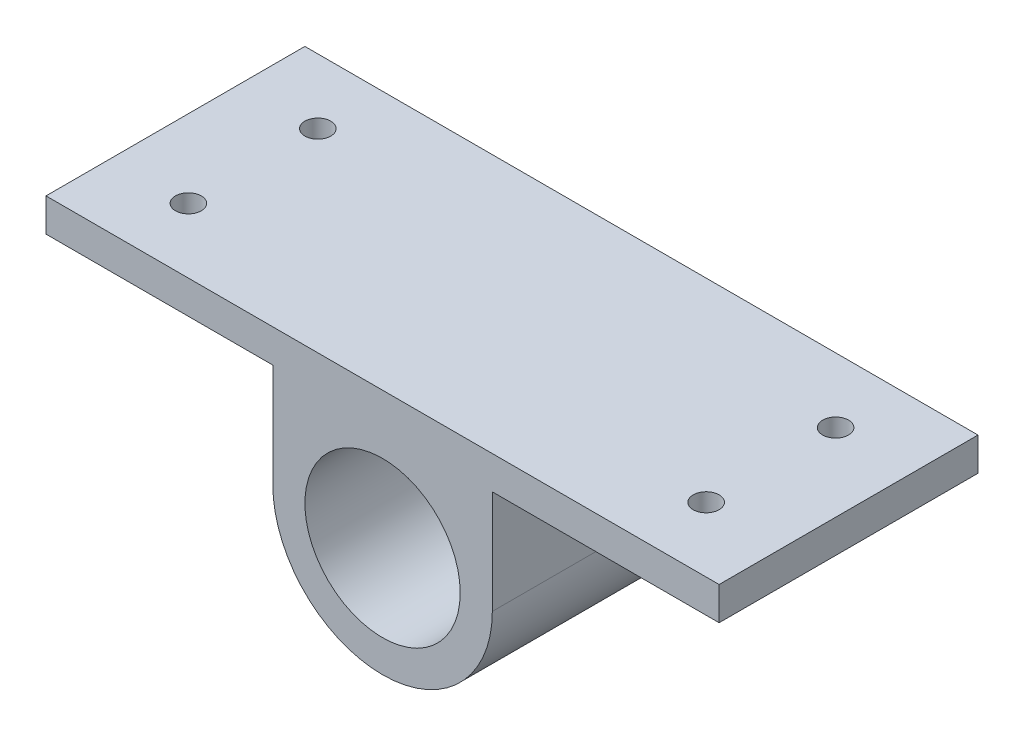
ISO-10303-21;
HEADER;
FILE_DESCRIPTION(('STEP AP214'),'2;1');
FILE_NAME('part.step','',(''),(''),'','','');
FILE_SCHEMA(('AUTOMOTIVE_DESIGN { 1 0 10303 214 1 1 1 1 }'));
ENDSEC;
DATA;
#1=APPLICATION_CONTEXT('core data for automotive mechanical design processes');
#2=APPLICATION_PROTOCOL_DEFINITION('international standard','automotive_design',2000,#1);
#3=PRODUCT_CONTEXT('',#1,'mechanical');
#4=PRODUCT('Part','Part','',(#3));
#5=PRODUCT_RELATED_PRODUCT_CATEGORY('part','',(#4));
#6=PRODUCT_DEFINITION_FORMATION('','',#4);
#7=PRODUCT_DEFINITION_CONTEXT('part definition',#1,'design');
#8=PRODUCT_DEFINITION('design','',#6,#7);
#9=PRODUCT_DEFINITION_SHAPE('','',#8);
#10=(LENGTH_UNIT() NAMED_UNIT(*) SI_UNIT(.MILLI.,.METRE.));
#11=(NAMED_UNIT(*) PLANE_ANGLE_UNIT() SI_UNIT($,.RADIAN.));
#12=(NAMED_UNIT(*) SI_UNIT($,.STERADIAN.) SOLID_ANGLE_UNIT());
#13=UNCERTAINTY_MEASURE_WITH_UNIT(LENGTH_MEASURE(1.E-05),#10,'distance_accuracy_value','');
#14=(GEOMETRIC_REPRESENTATION_CONTEXT(3) GLOBAL_UNCERTAINTY_ASSIGNED_CONTEXT((#13)) GLOBAL_UNIT_ASSIGNED_CONTEXT((#10,
#11,#12)) REPRESENTATION_CONTEXT('',''));
#15=CARTESIAN_POINT('',(0.,0.,0.));
#16=DIRECTION('',(0.,0.,1.));
#17=DIRECTION('',(1.,0.,0.));
#18=AXIS2_PLACEMENT_3D('',#15,#16,#17);
#19=CARTESIAN_POINT('',(-106.,0.,250.));
#20=DIRECTION('',(-1.,0.,0.));
#21=DIRECTION('',(0.,-1.,0.));
#22=AXIS2_PLACEMENT_3D('',#19,#20,#21);
#23=PLANE('',#22);
#24=DIRECTION('',(0.,1.,0.));
#25=VECTOR('',#24,1.);
#26=CARTESIAN_POINT('',(-106.,0.,0.));
#27=LINE('',#26,#25);
#28=CARTESIAN_POINT('',(-106.,-132.,0.));
#29=VERTEX_POINT('',#28);
#30=CARTESIAN_POINT('',(-106.,-32.,0.));
#31=VERTEX_POINT('',#30);
#32=EDGE_CURVE('E147',#29,#31,#27,.T.);
#33=ORIENTED_EDGE('',*,*,#32,.F.);
#34=DIRECTION('',(0.,0.,-1.));
#35=VECTOR('',#34,1.);
#36=CARTESIAN_POINT('',(-106.,-132.,250.));
#37=LINE('',#36,#35);
#38=CARTESIAN_POINT('',(-106.,-132.,250.));
#39=VERTEX_POINT('',#38);
#40=EDGE_CURVE('E11',#39,#29,#37,.T.);
#41=ORIENTED_EDGE('',*,*,#40,.F.);
#42=DIRECTION('',(0.,1.,0.));
#43=VECTOR('',#42,1.);
#44=CARTESIAN_POINT('',(-106.,0.,250.));
#45=LINE('',#44,#43);
#46=CARTESIAN_POINT('',(-106.,-32.,250.));
#47=VERTEX_POINT('',#46);
#48=EDGE_CURVE('E162',#39,#47,#45,.T.);
#49=ORIENTED_EDGE('',*,*,#48,.T.);
#50=DIRECTION('',(0.,0.,-1.));
#51=VECTOR('',#50,1.);
#52=CARTESIAN_POINT('',(-106.,-32.,250.));
#53=LINE('',#52,#51);
#54=EDGE_CURVE('E88',#47,#31,#53,.T.);
#55=ORIENTED_EDGE('',*,*,#54,.T.);
#56=EDGE_LOOP('',(#33,#41,#49,#55));
#57=FACE_BOUND('',#56,.T.);
#58=ADVANCED_FACE('F35',(#57),#23,.T.);
#59=CARTESIAN_POINT('',(0.,-132.,250.));
#60=DIRECTION('',(0.,0.,-1.));
#61=DIRECTION('',(-1.,0.,0.));
#62=AXIS2_PLACEMENT_3D('',#59,#60,#61);
#63=CYLINDRICAL_SURFACE('',#62,106.);
#64=CARTESIAN_POINT('',(0.,-132.,0.));
#65=DIRECTION('',(0.,0.,1.));
#66=DIRECTION('',(1.,0.,0.));
#67=AXIS2_PLACEMENT_3D('',#64,#65,#66);
#68=CIRCLE('',#67,106.);
#69=CARTESIAN_POINT('',(106.,-132.,0.));
#70=VERTEX_POINT('',#69);
#71=EDGE_CURVE('E175',#29,#70,#68,.T.);
#72=ORIENTED_EDGE('',*,*,#71,.T.);
#73=DIRECTION('',(0.,0.,-1.));
#74=VECTOR('',#73,1.);
#75=CARTESIAN_POINT('',(106.,-132.,250.));
#76=LINE('',#75,#74);
#77=CARTESIAN_POINT('',(106.,-132.,250.));
#78=VERTEX_POINT('',#77);
#79=EDGE_CURVE('E45',#78,#70,#76,.T.);
#80=ORIENTED_EDGE('',*,*,#79,.F.);
#81=CARTESIAN_POINT('',(0.,-132.,250.));
#82=DIRECTION('',(0.,0.,1.));
#83=DIRECTION('',(1.,0.,0.));
#84=AXIS2_PLACEMENT_3D('',#81,#82,#83);
#85=CIRCLE('',#84,106.);
#86=EDGE_CURVE('E164',#39,#78,#85,.T.);
#87=ORIENTED_EDGE('',*,*,#86,.F.);
#88=ORIENTED_EDGE('',*,*,#40,.T.);
#89=EDGE_LOOP('',(#72,#80,#87,#88));
#90=FACE_BOUND('',#89,.T.);
#91=ADVANCED_FACE('F195',(#90),#63,.T.);
#92=CARTESIAN_POINT('',(106.,0.,250.));
#93=DIRECTION('',(-1.,0.,0.));
#94=DIRECTION('',(0.,-1.,0.));
#95=AXIS2_PLACEMENT_3D('',#92,#93,#94);
#96=PLANE('',#95);
#97=DIRECTION('',(0.,1.,0.));
#98=VECTOR('',#97,1.);
#99=CARTESIAN_POINT('',(106.,0.,0.));
#100=LINE('',#99,#98);
#101=CARTESIAN_POINT('',(106.,-32.0000000000001,0.));
#102=VERTEX_POINT('',#101);
#103=EDGE_CURVE('E178',#70,#102,#100,.T.);
#104=ORIENTED_EDGE('',*,*,#103,.T.);
#105=DIRECTION('',(0.,0.,-1.));
#106=VECTOR('',#105,1.);
#107=CARTESIAN_POINT('',(106.,-32.0000000000001,250.));
#108=LINE('',#107,#106);
#109=CARTESIAN_POINT('',(106.,-32.0000000000001,250.));
#110=VERTEX_POINT('',#109);
#111=EDGE_CURVE('E137',#110,#102,#108,.T.);
#112=ORIENTED_EDGE('',*,*,#111,.F.);
#113=DIRECTION('',(0.,1.,0.));
#114=VECTOR('',#113,1.);
#115=CARTESIAN_POINT('',(106.,0.,250.));
#116=LINE('',#115,#114);
#117=EDGE_CURVE('E167',#78,#110,#116,.T.);
#118=ORIENTED_EDGE('',*,*,#117,.F.);
#119=ORIENTED_EDGE('',*,*,#79,.T.);
#120=EDGE_LOOP('',(#104,#112,#118,#119));
#121=FACE_BOUND('',#120,.T.);
#122=ADVANCED_FACE('F199',(#121),#96,.F.);
#123=CARTESIAN_POINT('',(0.,-32.0000000000001,250.));
#124=DIRECTION('',(0.,-1.,0.));
#125=DIRECTION('',(0.,0.,-1.));
#126=AXIS2_PLACEMENT_3D('',#123,#124,#125);
#127=PLANE('',#126);
#128=CARTESIAN_POINT('',(250.,-32.0000000000001,187.5));
#129=DIRECTION('',(0.,-1.,0.));
#130=DIRECTION('',(0.,0.,-1.));
#131=AXIS2_PLACEMENT_3D('',#128,#129,#130);
#132=CIRCLE('',#131,12.5);
#133=CARTESIAN_POINT('',(250.,-32.0000000000001,175.));
#134=VERTEX_POINT('',#133);
#135=EDGE_CURVE('E150',#134,#134,#132,.T.);
#136=ORIENTED_EDGE('',*,*,#135,.F.);
#137=EDGE_LOOP('',(#136));
#138=FACE_BOUND('',#137,.T.);
#139=CARTESIAN_POINT('',(250.,-32.0000000000001,62.5));
#140=DIRECTION('',(0.,-1.,0.));
#141=DIRECTION('',(0.,0.,-1.));
#142=AXIS2_PLACEMENT_3D('',#139,#140,#141);
#143=CIRCLE('',#142,12.5);
#144=CARTESIAN_POINT('',(250.,-32.0000000000001,50.));
#145=VERTEX_POINT('',#144);
#146=EDGE_CURVE('E155',#145,#145,#143,.T.);
#147=ORIENTED_EDGE('',*,*,#146,.F.);
#148=EDGE_LOOP('',(#147));
#149=FACE_BOUND('',#148,.T.);
#150=DIRECTION('',(-1.,0.,0.));
#151=VECTOR('',#150,1.);
#152=CARTESIAN_POINT('',(0.,-32.0000000000001,0.));
#153=LINE('',#152,#151);
#154=CARTESIAN_POINT('',(325.,-32.0000000000001,0.));
#155=VERTEX_POINT('',#154);
#156=EDGE_CURVE('E181',#155,#102,#153,.T.);
#157=ORIENTED_EDGE('',*,*,#156,.F.);
#158=DIRECTION('',(0.,0.,-1.));
#159=VECTOR('',#158,1.);
#160=CARTESIAN_POINT('',(325.,-32.0000000000001,250.));
#161=LINE('',#160,#159);
#162=CARTESIAN_POINT('',(325.,-32.0000000000001,250.));
#163=VERTEX_POINT('',#162);
#164=EDGE_CURVE('E131',#163,#155,#161,.T.);
#165=ORIENTED_EDGE('',*,*,#164,.F.);
#166=DIRECTION('',(-1.,0.,0.));
#167=VECTOR('',#166,1.);
#168=CARTESIAN_POINT('',(0.,-32.0000000000001,250.));
#169=LINE('',#168,#167);
#170=EDGE_CURVE('E169',#163,#110,#169,.T.);
#171=ORIENTED_EDGE('',*,*,#170,.T.);
#172=ORIENTED_EDGE('',*,*,#111,.T.);
#173=EDGE_LOOP('',(#157,#165,#171,#172));
#174=FACE_BOUND('',#173,.T.);
#175=ADVANCED_FACE('F205',(#138,#149,#174),#127,.T.);
#176=CARTESIAN_POINT('',(325.,0.,250.));
#177=DIRECTION('',(1.,0.,0.));
#178=DIRECTION('',(0.,0.,-1.));
#179=AXIS2_PLACEMENT_3D('',#176,#177,#178);
#180=PLANE('',#179);
#181=DIRECTION('',(0.,-1.,0.));
#182=VECTOR('',#181,1.);
#183=CARTESIAN_POINT('',(325.,0.,0.));
#184=LINE('',#183,#182);
#185=CARTESIAN_POINT('',(325.,0.,0.));
#186=VERTEX_POINT('',#185);
#187=EDGE_CURVE('E184',#186,#155,#184,.T.);
#188=ORIENTED_EDGE('',*,*,#187,.F.);
#189=DIRECTION('',(0.,0.,-1.));
#190=VECTOR('',#189,1.);
#191=CARTESIAN_POINT('',(325.,0.,250.));
#192=LINE('',#191,#190);
#193=CARTESIAN_POINT('',(325.,0.,250.));
#194=VERTEX_POINT('',#193);
#195=EDGE_CURVE('E129',#194,#186,#192,.T.);
#196=ORIENTED_EDGE('',*,*,#195,.F.);
#197=DIRECTION('',(0.,-1.,0.));
#198=VECTOR('',#197,1.);
#199=CARTESIAN_POINT('',(325.,0.,250.));
#200=LINE('',#199,#198);
#201=EDGE_CURVE('E123',#194,#163,#200,.T.);
#202=ORIENTED_EDGE('',*,*,#201,.T.);
#203=ORIENTED_EDGE('',*,*,#164,.T.);
#204=EDGE_LOOP('',(#188,#196,#202,#203));
#205=FACE_BOUND('',#204,.T.);
#206=ADVANCED_FACE('F209',(#205),#180,.T.);
#207=CARTESIAN_POINT('',(0.,0.,250.));
#208=DIRECTION('',(0.,-1.,0.));
#209=DIRECTION('',(1.,0.,0.));
#210=AXIS2_PLACEMENT_3D('',#207,#208,#209);
#211=PLANE('',#210);
#212=CARTESIAN_POINT('',(-250.,0.,62.5));
#213=DIRECTION('',(0.,1.,0.));
#214=DIRECTION('',(-1.,0.,0.));
#215=AXIS2_PLACEMENT_3D('',#212,#213,#214);
#216=CIRCLE('',#215,12.5);
#217=CARTESIAN_POINT('',(-262.5,0.,62.5));
#218=VERTEX_POINT('',#217);
#219=EDGE_CURVE('E247',#218,#218,#216,.T.);
#220=ORIENTED_EDGE('',*,*,#219,.F.);
#221=EDGE_LOOP('',(#220));
#222=FACE_BOUND('',#221,.T.);
#223=CARTESIAN_POINT('',(250.,0.,187.5));
#224=DIRECTION('',(0.,1.,0.));
#225=DIRECTION('',(1.,0.,0.));
#226=AXIS2_PLACEMENT_3D('',#223,#224,#225);
#227=CIRCLE('',#226,12.5);
#228=CARTESIAN_POINT('',(262.5,0.,187.5));
#229=VERTEX_POINT('',#228);
#230=EDGE_CURVE('E251',#229,#229,#227,.T.);
#231=ORIENTED_EDGE('',*,*,#230,.F.);
#232=EDGE_LOOP('',(#231));
#233=FACE_BOUND('',#232,.T.);
#234=CARTESIAN_POINT('',(250.,0.,62.5));
#235=DIRECTION('',(0.,1.,0.));
#236=DIRECTION('',(1.,0.,0.));
#237=AXIS2_PLACEMENT_3D('',#234,#235,#236);
#238=CIRCLE('',#237,12.5);
#239=CARTESIAN_POINT('',(262.5,0.,62.5));
#240=VERTEX_POINT('',#239);
#241=EDGE_CURVE('E254',#240,#240,#238,.T.);
#242=ORIENTED_EDGE('',*,*,#241,.F.);
#243=EDGE_LOOP('',(#242));
#244=FACE_BOUND('',#243,.T.);
#245=CARTESIAN_POINT('',(-250.,0.,187.5));
#246=DIRECTION('',(0.,1.,0.));
#247=DIRECTION('',(-1.,0.,0.));
#248=AXIS2_PLACEMENT_3D('',#245,#246,#247);
#249=CIRCLE('',#248,12.5);
#250=CARTESIAN_POINT('',(-262.5,0.,187.5));
#251=VERTEX_POINT('',#250);
#252=EDGE_CURVE('E143',#251,#251,#249,.T.);
#253=ORIENTED_EDGE('',*,*,#252,.F.);
#254=EDGE_LOOP('',(#253));
#255=FACE_BOUND('',#254,.T.);
#256=DIRECTION('',(-1.,0.,0.));
#257=VECTOR('',#256,1.);
#258=CARTESIAN_POINT('',(0.,0.,0.));
#259=LINE('',#258,#257);
#260=CARTESIAN_POINT('',(-325.,0.,0.));
#261=VERTEX_POINT('',#260);
#262=EDGE_CURVE('E128',#186,#261,#259,.T.);
#263=ORIENTED_EDGE('',*,*,#262,.T.);
#264=DIRECTION('',(0.,0.,-1.));
#265=VECTOR('',#264,1.);
#266=CARTESIAN_POINT('',(-325.,0.,250.));
#267=LINE('',#266,#265);
#268=CARTESIAN_POINT('',(-325.,0.,250.));
#269=VERTEX_POINT('',#268);
#270=EDGE_CURVE('E113',#269,#261,#267,.T.);
#271=ORIENTED_EDGE('',*,*,#270,.F.);
#272=DIRECTION('',(-1.,0.,0.));
#273=VECTOR('',#272,1.);
#274=CARTESIAN_POINT('',(0.,0.,250.));
#275=LINE('',#274,#273);
#276=EDGE_CURVE('E116',#194,#269,#275,.T.);
#277=ORIENTED_EDGE('',*,*,#276,.F.);
#278=ORIENTED_EDGE('',*,*,#195,.T.);
#279=EDGE_LOOP('',(#263,#271,#277,#278));
#280=FACE_BOUND('',#279,.T.);
#281=ADVANCED_FACE('F126',(#222,#233,#244,#255,#280),#211,.F.);
#282=CARTESIAN_POINT('',(-325.,0.,250.));
#283=DIRECTION('',(1.,0.,0.));
#284=DIRECTION('',(0.,0.,-1.));
#285=AXIS2_PLACEMENT_3D('',#282,#283,#284);
#286=PLANE('',#285);
#287=DIRECTION('',(0.,-1.,0.));
#288=VECTOR('',#287,1.);
#289=CARTESIAN_POINT('',(-325.,0.,0.));
#290=LINE('',#289,#288);
#291=CARTESIAN_POINT('',(-325.,-32.,0.));
#292=VERTEX_POINT('',#291);
#293=EDGE_CURVE('E188',#261,#292,#290,.T.);
#294=ORIENTED_EDGE('',*,*,#293,.T.);
#295=DIRECTION('',(0.,0.,-1.));
#296=VECTOR('',#295,1.);
#297=CARTESIAN_POINT('',(-325.,-32.,250.));
#298=LINE('',#297,#296);
#299=CARTESIAN_POINT('',(-325.,-32.,250.));
#300=VERTEX_POINT('',#299);
#301=EDGE_CURVE('E115',#300,#292,#298,.T.);
#302=ORIENTED_EDGE('',*,*,#301,.F.);
#303=DIRECTION('',(0.,-1.,0.));
#304=VECTOR('',#303,1.);
#305=CARTESIAN_POINT('',(-325.,0.,250.));
#306=LINE('',#305,#304);
#307=EDGE_CURVE('E108',#269,#300,#306,.T.);
#308=ORIENTED_EDGE('',*,*,#307,.F.);
#309=ORIENTED_EDGE('',*,*,#270,.T.);
#310=EDGE_LOOP('',(#294,#302,#308,#309));
#311=FACE_BOUND('',#310,.T.);
#312=ADVANCED_FACE('F111',(#311),#286,.F.);
#313=CARTESIAN_POINT('',(0.,-132.,250.));
#314=DIRECTION('',(0.,0.,-1.));
#315=DIRECTION('',(-1.,0.,0.));
#316=AXIS2_PLACEMENT_3D('',#313,#314,#315);
#317=CYLINDRICAL_SURFACE('',#316,75.);
#318=CARTESIAN_POINT('',(0.,-132.,250.));
#319=DIRECTION('',(0.,0.,1.));
#320=DIRECTION('',(1.,0.,0.));
#321=AXIS2_PLACEMENT_3D('',#318,#319,#320);
#322=CIRCLE('',#321,75.);
#323=CARTESIAN_POINT('',(75.,-132.,250.));
#324=VERTEX_POINT('',#323);
#325=EDGE_CURVE('E159',#324,#324,#322,.T.);
#326=ORIENTED_EDGE('',*,*,#325,.T.);
#327=EDGE_LOOP('',(#326));
#328=FACE_BOUND('',#327,.T.);
#329=CARTESIAN_POINT('',(0.,-132.,0.));
#330=DIRECTION('',(0.,0.,1.));
#331=DIRECTION('',(1.,0.,0.));
#332=AXIS2_PLACEMENT_3D('',#329,#330,#331);
#333=CIRCLE('',#332,75.);
#334=CARTESIAN_POINT('',(75.,-132.,0.));
#335=VERTEX_POINT('',#334);
#336=EDGE_CURVE('E142',#335,#335,#333,.T.);
#337=ORIENTED_EDGE('',*,*,#336,.F.);
#338=EDGE_LOOP('',(#337));
#339=FACE_BOUND('',#338,.T.);
#340=ADVANCED_FACE('F37',(#328,#339),#317,.F.);
#341=CARTESIAN_POINT('',(0.,-32.,250.));
#342=DIRECTION('',(0.,1.,0.));
#343=DIRECTION('',(0.,0.,1.));
#344=AXIS2_PLACEMENT_3D('',#341,#342,#343);
#345=PLANE('',#344);
#346=CARTESIAN_POINT('',(-250.,-32.,62.5));
#347=DIRECTION('',(0.,1.,0.));
#348=DIRECTION('',(0.,0.,1.));
#349=AXIS2_PLACEMENT_3D('',#346,#347,#348);
#350=CIRCLE('',#349,12.5);
#351=CARTESIAN_POINT('',(-250.,-32.,75.));
#352=VERTEX_POINT('',#351);
#353=EDGE_CURVE('E39',#352,#352,#350,.T.);
#354=ORIENTED_EDGE('',*,*,#353,.T.);
#355=EDGE_LOOP('',(#354));
#356=FACE_BOUND('',#355,.T.);
#357=CARTESIAN_POINT('',(-250.,-32.,187.5));
#358=DIRECTION('',(0.,1.,0.));
#359=DIRECTION('',(0.,0.,1.));
#360=AXIS2_PLACEMENT_3D('',#357,#358,#359);
#361=CIRCLE('',#360,12.5);
#362=CARTESIAN_POINT('',(-250.,-32.,200.));
#363=VERTEX_POINT('',#362);
#364=EDGE_CURVE('E140',#363,#363,#361,.T.);
#365=ORIENTED_EDGE('',*,*,#364,.T.);
#366=EDGE_LOOP('',(#365));
#367=FACE_BOUND('',#366,.T.);
#368=DIRECTION('',(1.,0.,0.));
#369=VECTOR('',#368,1.);
#370=CARTESIAN_POINT('',(0.,-32.,0.));
#371=LINE('',#370,#369);
#372=EDGE_CURVE('E81',#292,#31,#371,.T.);
#373=ORIENTED_EDGE('',*,*,#372,.T.);
#374=ORIENTED_EDGE('',*,*,#54,.F.);
#375=DIRECTION('',(1.,0.,0.));
#376=VECTOR('',#375,1.);
#377=CARTESIAN_POINT('',(0.,-32.,250.));
#378=LINE('',#377,#376);
#379=EDGE_CURVE('E54',#300,#47,#378,.T.);
#380=ORIENTED_EDGE('',*,*,#379,.F.);
#381=ORIENTED_EDGE('',*,*,#301,.T.);
#382=EDGE_LOOP('',(#373,#374,#380,#381));
#383=FACE_BOUND('',#382,.T.);
#384=ADVANCED_FACE('F191',(#356,#367,#383),#345,.F.);
#385=CARTESIAN_POINT('',(0.,0.,250.));
#386=DIRECTION('',(0.,0.,1.));
#387=DIRECTION('',(1.,0.,0.));
#388=AXIS2_PLACEMENT_3D('',#385,#386,#387);
#389=PLANE('',#388);
#390=ORIENTED_EDGE('',*,*,#325,.F.);
#391=EDGE_LOOP('',(#390));
#392=FACE_BOUND('',#391,.T.);
#393=ORIENTED_EDGE('',*,*,#48,.F.);
#394=ORIENTED_EDGE('',*,*,#86,.T.);
#395=ORIENTED_EDGE('',*,*,#117,.T.);
#396=ORIENTED_EDGE('',*,*,#170,.F.);
#397=ORIENTED_EDGE('',*,*,#201,.F.);
#398=ORIENTED_EDGE('',*,*,#276,.T.);
#399=ORIENTED_EDGE('',*,*,#307,.T.);
#400=ORIENTED_EDGE('',*,*,#379,.T.);
#401=EDGE_LOOP('',(#393,#394,#395,#396,#397,#398,#399,#400));
#402=FACE_BOUND('',#401,.T.);
#403=ADVANCED_FACE('F120',(#392,#402),#389,.T.);
#404=CARTESIAN_POINT('',(0.,0.,0.));
#405=DIRECTION('',(0.,0.,1.));
#406=DIRECTION('',(1.,0.,0.));
#407=AXIS2_PLACEMENT_3D('',#404,#405,#406);
#408=PLANE('',#407);
#409=ORIENTED_EDGE('',*,*,#336,.T.);
#410=EDGE_LOOP('',(#409));
#411=FACE_BOUND('',#410,.T.);
#412=ORIENTED_EDGE('',*,*,#32,.T.);
#413=ORIENTED_EDGE('',*,*,#372,.F.);
#414=ORIENTED_EDGE('',*,*,#293,.F.);
#415=ORIENTED_EDGE('',*,*,#262,.F.);
#416=ORIENTED_EDGE('',*,*,#187,.T.);
#417=ORIENTED_EDGE('',*,*,#156,.T.);
#418=ORIENTED_EDGE('',*,*,#103,.F.);
#419=ORIENTED_EDGE('',*,*,#71,.F.);
#420=EDGE_LOOP('',(#412,#413,#414,#415,#416,#417,#418,#419));
#421=FACE_BOUND('',#420,.T.);
#422=ADVANCED_FACE('F193',(#411,#421),#408,.F.);
#423=CARTESIAN_POINT('',(-250.,-250.,187.5));
#424=DIRECTION('',(0.,1.,0.));
#425=DIRECTION('',(-1.,0.,0.));
#426=AXIS2_PLACEMENT_3D('',#423,#424,#425);
#427=CYLINDRICAL_SURFACE('',#426,12.5);
#428=ORIENTED_EDGE('',*,*,#252,.T.);
#429=EDGE_LOOP('',(#428));
#430=FACE_BOUND('',#429,.T.);
#431=ORIENTED_EDGE('',*,*,#364,.F.);
#432=EDGE_LOOP('',(#431));
#433=FACE_BOUND('',#432,.T.);
#434=ADVANCED_FACE('F224',(#430,#433),#427,.F.);
#435=CARTESIAN_POINT('',(-250.,-250.,62.5));
#436=DIRECTION('',(0.,1.,0.));
#437=DIRECTION('',(-1.,0.,0.));
#438=AXIS2_PLACEMENT_3D('',#435,#436,#437);
#439=CYLINDRICAL_SURFACE('',#438,12.5);
#440=ORIENTED_EDGE('',*,*,#219,.T.);
#441=EDGE_LOOP('',(#440));
#442=FACE_BOUND('',#441,.T.);
#443=ORIENTED_EDGE('',*,*,#353,.F.);
#444=EDGE_LOOP('',(#443));
#445=FACE_BOUND('',#444,.T.);
#446=ADVANCED_FACE('F231',(#442,#445),#439,.F.);
#447=CARTESIAN_POINT('',(250.,-250.,62.5));
#448=DIRECTION('',(0.,1.,0.));
#449=DIRECTION('',(-1.,0.,0.));
#450=AXIS2_PLACEMENT_3D('',#447,#448,#449);
#451=CYLINDRICAL_SURFACE('',#450,12.5);
#452=ORIENTED_EDGE('',*,*,#146,.T.);
#453=EDGE_LOOP('',(#452));
#454=FACE_BOUND('',#453,.T.);
#455=ORIENTED_EDGE('',*,*,#241,.T.);
#456=EDGE_LOOP('',(#455));
#457=FACE_BOUND('',#456,.T.);
#458=ADVANCED_FACE('F232',(#454,#457),#451,.F.);
#459=CARTESIAN_POINT('',(250.,-250.,187.5));
#460=DIRECTION('',(0.,1.,0.));
#461=DIRECTION('',(-1.,0.,0.));
#462=AXIS2_PLACEMENT_3D('',#459,#460,#461);
#463=CYLINDRICAL_SURFACE('',#462,12.5);
#464=ORIENTED_EDGE('',*,*,#135,.T.);
#465=EDGE_LOOP('',(#464));
#466=FACE_BOUND('',#465,.T.);
#467=ORIENTED_EDGE('',*,*,#230,.T.);
#468=EDGE_LOOP('',(#467));
#469=FACE_BOUND('',#468,.T.);
#470=ADVANCED_FACE('F235',(#466,#469),#463,.F.);
#471=CLOSED_SHELL('',(#58,#91,#122,#175,#206,#281,#312,#340,#384,#403,#422,#434,#446,#458,#470));
#472=MANIFOLD_SOLID_BREP('B2',#471);
#473=ADVANCED_BREP_SHAPE_REPRESENTATION('',(#18,#472),#14);
#474=SHAPE_DEFINITION_REPRESENTATION(#9,#473);
ENDSEC;
END-ISO-10303-21;
